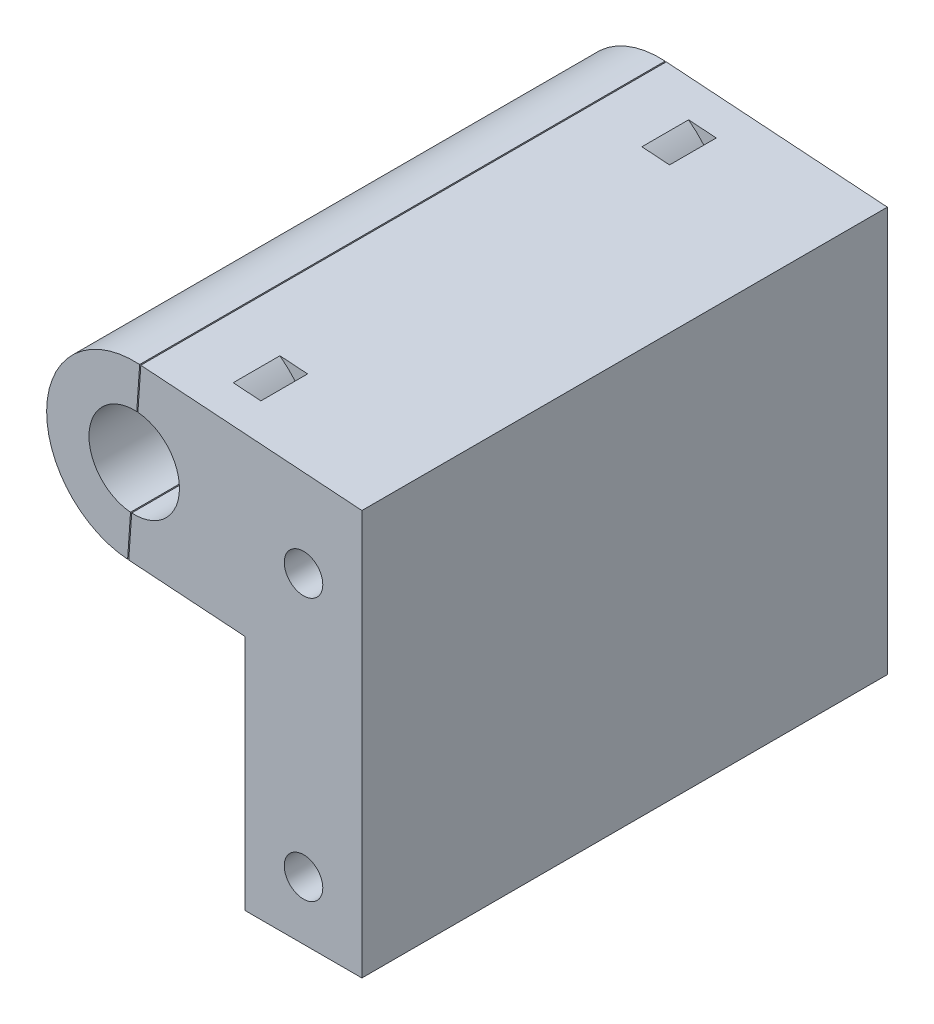
ISO-10303-21;
HEADER;
FILE_DESCRIPTION(('STEP AP214'),'2;1');
FILE_NAME('part.step','',(''),(''),'','','');
FILE_SCHEMA(('AUTOMOTIVE_DESIGN { 1 0 10303 214 1 1 1 1 }'));
ENDSEC;
DATA;
#1=APPLICATION_CONTEXT('core data for automotive mechanical design processes');
#2=APPLICATION_PROTOCOL_DEFINITION('international standard','automotive_design',2000,#1);
#3=PRODUCT_CONTEXT('',#1,'mechanical');
#4=PRODUCT('Part','Part','',(#3));
#5=PRODUCT_RELATED_PRODUCT_CATEGORY('part','',(#4));
#6=PRODUCT_DEFINITION_FORMATION('','',#4);
#7=PRODUCT_DEFINITION_CONTEXT('part definition',#1,'design');
#8=PRODUCT_DEFINITION('design','',#6,#7);
#9=PRODUCT_DEFINITION_SHAPE('','',#8);
#10=(LENGTH_UNIT() NAMED_UNIT(*) SI_UNIT(.MILLI.,.METRE.));
#11=(NAMED_UNIT(*) PLANE_ANGLE_UNIT() SI_UNIT($,.RADIAN.));
#12=(NAMED_UNIT(*) SI_UNIT($,.STERADIAN.) SOLID_ANGLE_UNIT());
#13=UNCERTAINTY_MEASURE_WITH_UNIT(LENGTH_MEASURE(1.E-05),#10,'distance_accuracy_value','');
#14=(GEOMETRIC_REPRESENTATION_CONTEXT(3) GLOBAL_UNCERTAINTY_ASSIGNED_CONTEXT((#13)) GLOBAL_UNIT_ASSIGNED_CONTEXT((#10,
#11,#12)) REPRESENTATION_CONTEXT('',''));
#15=CARTESIAN_POINT('',(0.,0.,0.));
#16=DIRECTION('',(0.,0.,1.));
#17=DIRECTION('',(1.,0.,0.));
#18=AXIS2_PLACEMENT_3D('',#15,#16,#17);
#19=CARTESIAN_POINT('',(-182.516015687115,162.517772536827,45.));
#20=DIRECTION('',(0.0688020916153644,0.997630328422984,0.));
#21=DIRECTION('',(-0.997630328422984,0.0688020916153644,0.));
#22=AXIS2_PLACEMENT_3D('',#19,#20,#21);
#23=PLANE('',#22);
#24=DIRECTION('',(-0.997630328422984,0.0688020916153644,0.));
#25=VECTOR('',#24,1.);
#26=CARTESIAN_POINT('',(-182.516015687115,162.517772536827,7.));
#27=LINE('',#26,#25);
#28=CARTESIAN_POINT('',(-175.184959917431,162.012182483746,7.));
#29=VERTEX_POINT('',#28);
#30=CARTESIAN_POINT('',(-177.552867468828,162.175486452808,7.));
#31=VERTEX_POINT('',#30);
#32=EDGE_CURVE('E287',#29,#31,#27,.T.);
#33=ORIENTED_EDGE('',*,*,#32,.F.);
#34=DIRECTION('',(0.,0.,-1.));
#35=VECTOR('',#34,1.);
#36=CARTESIAN_POINT('',(-175.184959917431,162.012182483746,7.));
#37=LINE('',#36,#35);
#38=CARTESIAN_POINT('',(-175.184959917431,162.012182483746,3.));
#39=VERTEX_POINT('',#38);
#40=EDGE_CURVE('E284',#29,#39,#37,.T.);
#41=ORIENTED_EDGE('',*,*,#40,.T.);
#42=DIRECTION('',(-0.997630328422984,0.0688020916153644,0.));
#43=VECTOR('',#42,1.);
#44=CARTESIAN_POINT('',(-182.516015687115,162.517772536827,3.));
#45=LINE('',#44,#43);
#46=CARTESIAN_POINT('',(-177.552867468828,162.175486452808,3.));
#47=VERTEX_POINT('',#46);
#48=EDGE_CURVE('E217',#39,#47,#45,.T.);
#49=ORIENTED_EDGE('',*,*,#48,.T.);
#50=DIRECTION('',(0.,0.,-1.));
#51=VECTOR('',#50,1.);
#52=CARTESIAN_POINT('',(-177.552867468828,162.175486452808,7.));
#53=LINE('',#52,#51);
#54=EDGE_CURVE('E291',#31,#47,#53,.T.);
#55=ORIENTED_EDGE('',*,*,#54,.F.);
#56=EDGE_LOOP('',(#33,#41,#49,#55));
#57=FACE_BOUND('',#56,.T.);
#58=DIRECTION('',(0.997630328422984,-0.0688020916153644,0.));
#59=VECTOR('',#58,1.);
#60=CARTESIAN_POINT('',(-182.516015687115,162.517772536827,45.));
#61=LINE('',#60,#59);
#62=CARTESIAN_POINT('',(-182.466134170694,162.514332432247,45.));
#63=VERTEX_POINT('',#62);
#64=CARTESIAN_POINT('',(-172.5,161.827012834268,45.));
#65=VERTEX_POINT('',#64);
#66=EDGE_CURVE('E282',#63,#65,#61,.T.);
#67=ORIENTED_EDGE('',*,*,#66,.F.);
#68=DIRECTION('',(0.,0.,-1.));
#69=VECTOR('',#68,1.);
#70=CARTESIAN_POINT('',(-182.466134170694,162.514332432247,45.));
#71=LINE('',#70,#69);
#72=CARTESIAN_POINT('',(-182.466134170694,162.514332432247,0.));
#73=VERTEX_POINT('',#72);
#74=EDGE_CURVE('E86',#63,#73,#71,.T.);
#75=ORIENTED_EDGE('',*,*,#74,.T.);
#76=DIRECTION('',(0.997630328422984,-0.0688020916153644,0.));
#77=VECTOR('',#76,1.);
#78=CARTESIAN_POINT('',(-182.516015687115,162.517772536827,0.));
#79=LINE('',#78,#77);
#80=CARTESIAN_POINT('',(-172.5,161.827012834268,0.));
#81=VERTEX_POINT('',#80);
#82=EDGE_CURVE('E173',#73,#81,#79,.T.);
#83=ORIENTED_EDGE('',*,*,#82,.T.);
#84=DIRECTION('',(0.,0.,-1.));
#85=VECTOR('',#84,1.);
#86=CARTESIAN_POINT('',(-172.5,161.827012834268,45.));
#87=LINE('',#86,#85);
#88=EDGE_CURVE('E256',#65,#81,#87,.T.);
#89=ORIENTED_EDGE('',*,*,#88,.F.);
#90=EDGE_LOOP('',(#67,#75,#83,#89));
#91=FACE_BOUND('',#90,.T.);
#92=DIRECTION('',(0.997630328422984,-0.0688020916153644,0.));
#93=VECTOR('',#92,1.);
#94=CARTESIAN_POINT('',(-182.516015687115,162.517772536827,38.));
#95=LINE('',#94,#93);
#96=CARTESIAN_POINT('',(-177.552867468828,162.175486452808,38.));
#97=VERTEX_POINT('',#96);
#98=CARTESIAN_POINT('',(-175.184959917431,162.012182483746,38.));
#99=VERTEX_POINT('',#98);
#100=EDGE_CURVE('E179',#97,#99,#95,.T.);
#101=ORIENTED_EDGE('',*,*,#100,.F.);
#102=DIRECTION('',(0.,0.,1.));
#103=VECTOR('',#102,1.);
#104=CARTESIAN_POINT('',(-177.552867468828,162.175486452808,38.));
#105=LINE('',#104,#103);
#106=CARTESIAN_POINT('',(-177.552867468828,162.175486452808,42.));
#107=VERTEX_POINT('',#106);
#108=EDGE_CURVE('E162',#97,#107,#105,.T.);
#109=ORIENTED_EDGE('',*,*,#108,.T.);
#110=DIRECTION('',(0.997630328422984,-0.0688020916153644,0.));
#111=VECTOR('',#110,1.);
#112=CARTESIAN_POINT('',(-182.516015687115,162.517772536827,42.));
#113=LINE('',#112,#111);
#114=CARTESIAN_POINT('',(-175.184959917431,162.012182483746,42.));
#115=VERTEX_POINT('',#114);
#116=EDGE_CURVE('E172',#107,#115,#113,.T.);
#117=ORIENTED_EDGE('',*,*,#116,.T.);
#118=DIRECTION('',(0.,0.,1.));
#119=VECTOR('',#118,1.);
#120=CARTESIAN_POINT('',(-175.184959917431,162.012182483746,38.));
#121=LINE('',#120,#119);
#122=EDGE_CURVE('E188',#99,#115,#121,.T.);
#123=ORIENTED_EDGE('',*,*,#122,.F.);
#124=EDGE_LOOP('',(#101,#109,#117,#123));
#125=FACE_BOUND('',#124,.T.);
#126=ADVANCED_FACE('F45',(#57,#91,#125),#23,.F.);
#127=CARTESIAN_POINT('',(-181.483984312885,177.482227463172,45.));
#128=DIRECTION('',(-0.0688020916153632,-0.997630328422984,0.));
#129=DIRECTION('',(0.997630328422984,-0.0688020916153632,0.));
#130=AXIS2_PLACEMENT_3D('',#127,#128,#129);
#131=PLANE('',#130);
#132=DIRECTION('',(0.997630328422984,-0.0688020916153632,0.));
#133=VECTOR('',#132,1.);
#134=CARTESIAN_POINT('',(-181.483984312885,177.482227463172,7.));
#135=LINE('',#134,#133);
#136=CARTESIAN_POINT('',(-176.520836094598,177.139941379152,7.));
#137=VERTEX_POINT('',#136);
#138=CARTESIAN_POINT('',(-174.1529285432,176.976637410091,7.));
#139=VERTEX_POINT('',#138);
#140=EDGE_CURVE('E245',#137,#139,#135,.T.);
#141=ORIENTED_EDGE('',*,*,#140,.F.);
#142=DIRECTION('',(0.,0.,-1.));
#143=VECTOR('',#142,1.);
#144=CARTESIAN_POINT('',(-176.520836094598,177.139941379152,7.));
#145=LINE('',#144,#143);
#146=CARTESIAN_POINT('',(-176.520836094598,177.139941379152,3.));
#147=VERTEX_POINT('',#146);
#148=EDGE_CURVE('E198',#137,#147,#145,.T.);
#149=ORIENTED_EDGE('',*,*,#148,.T.);
#150=DIRECTION('',(0.997630328422984,-0.0688020916153632,0.));
#151=VECTOR('',#150,1.);
#152=CARTESIAN_POINT('',(-181.483984312885,177.482227463172,3.));
#153=LINE('',#152,#151);
#154=CARTESIAN_POINT('',(-174.1529285432,176.976637410091,3.));
#155=VERTEX_POINT('',#154);
#156=EDGE_CURVE('E253',#147,#155,#153,.T.);
#157=ORIENTED_EDGE('',*,*,#156,.T.);
#158=DIRECTION('',(0.,0.,-1.));
#159=VECTOR('',#158,1.);
#160=CARTESIAN_POINT('',(-174.1529285432,176.976637410091,7.));
#161=LINE('',#160,#159);
#162=EDGE_CURVE('E249',#155,#139,#161,.F.);
#163=ORIENTED_EDGE('',*,*,#162,.T.);
#164=EDGE_LOOP('',(#141,#149,#157,#163));
#165=FACE_BOUND('',#164,.T.);
#166=DIRECTION('',(-0.997630328422984,0.0688020916153632,0.));
#167=VECTOR('',#166,1.);
#168=CARTESIAN_POINT('',(-181.483984312885,177.482227463172,0.));
#169=LINE('',#168,#167);
#170=CARTESIAN_POINT('',(-162.5,176.172987165732,0.));
#171=VERTEX_POINT('',#170);
#172=CARTESIAN_POINT('',(-181.434102796463,177.478787358591,0.));
#173=VERTEX_POINT('',#172);
#174=EDGE_CURVE('E252',#171,#173,#169,.T.);
#175=ORIENTED_EDGE('',*,*,#174,.T.);
#176=DIRECTION('',(0.,0.,-1.));
#177=VECTOR('',#176,1.);
#178=CARTESIAN_POINT('',(-181.434102796463,177.478787358591,45.));
#179=LINE('',#178,#177);
#180=CARTESIAN_POINT('',(-181.434102796463,177.478787358591,45.));
#181=VERTEX_POINT('',#180);
#182=EDGE_CURVE('E55',#181,#173,#179,.T.);
#183=ORIENTED_EDGE('',*,*,#182,.F.);
#184=DIRECTION('',(-0.997630328422984,0.0688020916153632,0.));
#185=VECTOR('',#184,1.);
#186=CARTESIAN_POINT('',(-181.483984312885,177.482227463172,45.));
#187=LINE('',#186,#185);
#188=CARTESIAN_POINT('',(-162.5,176.172987165732,45.));
#189=VERTEX_POINT('',#188);
#190=EDGE_CURVE('E220',#189,#181,#187,.T.);
#191=ORIENTED_EDGE('',*,*,#190,.F.);
#192=DIRECTION('',(0.,0.,-1.));
#193=VECTOR('',#192,1.);
#194=CARTESIAN_POINT('',(-162.5,176.172987165732,45.));
#195=LINE('',#194,#193);
#196=EDGE_CURVE('E244',#189,#171,#195,.T.);
#197=ORIENTED_EDGE('',*,*,#196,.T.);
#198=EDGE_LOOP('',(#175,#183,#191,#197));
#199=FACE_BOUND('',#198,.T.);
#200=DIRECTION('',(-0.997630328422984,0.0688020916153632,0.));
#201=VECTOR('',#200,1.);
#202=CARTESIAN_POINT('',(-181.483984312885,177.482227463172,38.));
#203=LINE('',#202,#201);
#204=CARTESIAN_POINT('',(-174.1529285432,176.976637410091,38.));
#205=VERTEX_POINT('',#204);
#206=CARTESIAN_POINT('',(-176.520836094598,177.139941379152,38.));
#207=VERTEX_POINT('',#206);
#208=EDGE_CURVE('E182',#205,#207,#203,.T.);
#209=ORIENTED_EDGE('',*,*,#208,.F.);
#210=DIRECTION('',(0.,0.,1.));
#211=VECTOR('',#210,1.);
#212=CARTESIAN_POINT('',(-174.1529285432,176.976637410091,38.));
#213=LINE('',#212,#211);
#214=CARTESIAN_POINT('',(-174.1529285432,176.976637410091,42.));
#215=VERTEX_POINT('',#214);
#216=EDGE_CURVE('E192',#215,#205,#213,.F.);
#217=ORIENTED_EDGE('',*,*,#216,.F.);
#218=DIRECTION('',(-0.997630328422984,0.0688020916153632,0.));
#219=VECTOR('',#218,1.);
#220=CARTESIAN_POINT('',(-181.483984312885,177.482227463172,42.));
#221=LINE('',#220,#219);
#222=CARTESIAN_POINT('',(-176.520836094598,177.139941379152,42.));
#223=VERTEX_POINT('',#222);
#224=EDGE_CURVE('E240',#215,#223,#221,.T.);
#225=ORIENTED_EDGE('',*,*,#224,.T.);
#226=DIRECTION('',(0.,0.,1.));
#227=VECTOR('',#226,1.);
#228=CARTESIAN_POINT('',(-176.520836094598,177.139941379152,38.));
#229=LINE('',#228,#227);
#230=EDGE_CURVE('E183',#207,#223,#229,.T.);
#231=ORIENTED_EDGE('',*,*,#230,.F.);
#232=EDGE_LOOP('',(#209,#217,#225,#231));
#233=FACE_BOUND('',#232,.T.);
#234=ADVANCED_FACE('F317',(#165,#199,#233),#131,.F.);
#235=CARTESIAN_POINT('',(-172.5,161.827012834268,45.));
#236=DIRECTION('',(1.,0.,0.));
#237=DIRECTION('',(0.,0.,-1.));
#238=AXIS2_PLACEMENT_3D('',#235,#236,#237);
#239=PLANE('',#238);
#240=DIRECTION('',(0.,-1.,0.));
#241=VECTOR('',#240,1.);
#242=CARTESIAN_POINT('',(-172.5,161.827012834268,0.));
#243=LINE('',#242,#241);
#244=CARTESIAN_POINT('',(-172.5,141.5,0.));
#245=VERTEX_POINT('',#244);
#246=EDGE_CURVE('E243',#81,#245,#243,.T.);
#247=ORIENTED_EDGE('',*,*,#246,.T.);
#248=DIRECTION('',(0.,0.,-1.));
#249=VECTOR('',#248,1.);
#250=CARTESIAN_POINT('',(-172.5,141.5,45.));
#251=LINE('',#250,#249);
#252=CARTESIAN_POINT('',(-172.5,141.5,45.));
#253=VERTEX_POINT('',#252);
#254=EDGE_CURVE('E260',#253,#245,#251,.T.);
#255=ORIENTED_EDGE('',*,*,#254,.F.);
#256=DIRECTION('',(0.,-1.,0.));
#257=VECTOR('',#256,1.);
#258=CARTESIAN_POINT('',(-172.5,161.827012834268,45.));
#259=LINE('',#258,#257);
#260=EDGE_CURVE('E280',#65,#253,#259,.T.);
#261=ORIENTED_EDGE('',*,*,#260,.F.);
#262=ORIENTED_EDGE('',*,*,#88,.T.);
#263=EDGE_LOOP('',(#247,#255,#261,#262));
#264=FACE_BOUND('',#263,.T.);
#265=ADVANCED_FACE('F336',(#264),#239,.F.);
#266=CARTESIAN_POINT('',(-172.5,141.5,45.));
#267=DIRECTION('',(0.,1.,0.));
#268=DIRECTION('',(0.,0.,1.));
#269=AXIS2_PLACEMENT_3D('',#266,#267,#268);
#270=PLANE('',#269);
#271=DIRECTION('',(1.,0.,0.));
#272=VECTOR('',#271,1.);
#273=CARTESIAN_POINT('',(-172.5,141.5,0.));
#274=LINE('',#273,#272);
#275=CARTESIAN_POINT('',(-162.5,141.5,0.));
#276=VERTEX_POINT('',#275);
#277=EDGE_CURVE('E259',#245,#276,#274,.T.);
#278=ORIENTED_EDGE('',*,*,#277,.T.);
#279=DIRECTION('',(0.,0.,-1.));
#280=VECTOR('',#279,1.);
#281=CARTESIAN_POINT('',(-162.5,141.5,45.));
#282=LINE('',#281,#280);
#283=CARTESIAN_POINT('',(-162.5,141.5,45.));
#284=VERTEX_POINT('',#283);
#285=EDGE_CURVE('E264',#284,#276,#282,.T.);
#286=ORIENTED_EDGE('',*,*,#285,.F.);
#287=DIRECTION('',(1.,0.,0.));
#288=VECTOR('',#287,1.);
#289=CARTESIAN_POINT('',(-172.5,141.5,45.));
#290=LINE('',#289,#288);
#291=EDGE_CURVE('E278',#253,#284,#290,.T.);
#292=ORIENTED_EDGE('',*,*,#291,.F.);
#293=ORIENTED_EDGE('',*,*,#254,.T.);
#294=EDGE_LOOP('',(#278,#286,#292,#293));
#295=FACE_BOUND('',#294,.T.);
#296=ADVANCED_FACE('F341',(#295),#270,.F.);
#297=CARTESIAN_POINT('',(-162.5,176.172987165732,45.));
#298=DIRECTION('',(-1.,0.,0.));
#299=DIRECTION('',(0.,0.,1.));
#300=AXIS2_PLACEMENT_3D('',#297,#298,#299);
#301=PLANE('',#300);
#302=DIRECTION('',(0.,1.,0.));
#303=VECTOR('',#302,1.);
#304=CARTESIAN_POINT('',(-162.5,176.172987165732,0.));
#305=LINE('',#304,#303);
#306=EDGE_CURVE('E263',#276,#171,#305,.T.);
#307=ORIENTED_EDGE('',*,*,#306,.T.);
#308=ORIENTED_EDGE('',*,*,#196,.F.);
#309=DIRECTION('',(0.,1.,0.));
#310=VECTOR('',#309,1.);
#311=CARTESIAN_POINT('',(-162.5,176.172987165732,45.));
#312=LINE('',#311,#310);
#313=EDGE_CURVE('E276',#284,#189,#312,.T.);
#314=ORIENTED_EDGE('',*,*,#313,.F.);
#315=ORIENTED_EDGE('',*,*,#285,.T.);
#316=EDGE_LOOP('',(#307,#308,#314,#315));
#317=FACE_BOUND('',#316,.T.);
#318=ADVANCED_FACE('F345',(#317),#301,.F.);
#319=CARTESIAN_POINT('',(-182.,170.,45.));
#320=DIRECTION('',(0.,0.,1.));
#321=DIRECTION('',(1.,0.,0.));
#322=AXIS2_PLACEMENT_3D('',#319,#320,#321);
#323=PLANE('',#322);
#324=DIRECTION('',(-0.0688020916153647,-0.997630328422984,0.));
#325=VECTOR('',#324,1.);
#326=CARTESIAN_POINT('',(-181.434102796463,177.478787358591,45.));
#327=LINE('',#326,#325);
#328=CARTESIAN_POINT('',(-182.216704393441,166.131064202411,45.));
#329=VERTEX_POINT('',#328);
#330=EDGE_CURVE('E89',#329,#63,#327,.T.);
#331=ORIENTED_EDGE('',*,*,#330,.T.);
#332=ORIENTED_EDGE('',*,*,#66,.T.);
#333=ORIENTED_EDGE('',*,*,#260,.T.);
#334=ORIENTED_EDGE('',*,*,#291,.T.);
#335=ORIENTED_EDGE('',*,*,#313,.T.);
#336=ORIENTED_EDGE('',*,*,#190,.T.);
#337=CARTESIAN_POINT('',(-181.683532573716,173.862055588427,45.));
#338=VERTEX_POINT('',#337);
#339=EDGE_CURVE('E219',#181,#338,#327,.T.);
#340=ORIENTED_EDGE('',*,*,#339,.T.);
#341=CARTESIAN_POINT('',(-182.,170.,45.));
#342=DIRECTION('',(0.,0.,1.));
#343=DIRECTION('',(1.,0.,0.));
#344=AXIS2_PLACEMENT_3D('',#341,#342,#343);
#345=CIRCLE('',#344,3.87499999999999);
#346=EDGE_CURVE('E49',#329,#338,#345,.T.);
#347=ORIENTED_EDGE('',*,*,#346,.F.);
#348=EDGE_LOOP('',(#331,#332,#333,#334,#335,#336,#340,#347));
#349=FACE_BOUND('',#348,.T.);
#350=CARTESIAN_POINT('',(-167.5,169.,45.));
#351=DIRECTION('',(0.,0.,1.));
#352=DIRECTION('',(1.,0.,0.));
#353=AXIS2_PLACEMENT_3D('',#350,#351,#352);
#354=CIRCLE('',#353,1.64999999999998);
#355=CARTESIAN_POINT('',(-165.85,169.,45.));
#356=VERTEX_POINT('',#355);
#357=EDGE_CURVE('E210',#356,#356,#354,.T.);
#358=ORIENTED_EDGE('',*,*,#357,.F.);
#359=EDGE_LOOP('',(#358));
#360=FACE_BOUND('',#359,.T.);
#361=CARTESIAN_POINT('',(-167.5,146.5,45.));
#362=DIRECTION('',(0.,0.,1.));
#363=DIRECTION('',(1.,0.,0.));
#364=AXIS2_PLACEMENT_3D('',#361,#362,#363);
#365=CIRCLE('',#364,1.64999999999998);
#366=CARTESIAN_POINT('',(-165.85,146.5,45.));
#367=VERTEX_POINT('',#366);
#368=EDGE_CURVE('E199',#367,#367,#365,.T.);
#369=ORIENTED_EDGE('',*,*,#368,.F.);
#370=EDGE_LOOP('',(#369));
#371=FACE_BOUND('',#370,.T.);
#372=ADVANCED_FACE('F47',(#349,#360,#371),#323,.T.);
#373=CARTESIAN_POINT('',(-182.,170.,0.));
#374=DIRECTION('',(0.,0.,1.));
#375=DIRECTION('',(1.,0.,0.));
#376=AXIS2_PLACEMENT_3D('',#373,#374,#375);
#377=PLANE('',#376);
#378=ORIENTED_EDGE('',*,*,#82,.F.);
#379=DIRECTION('',(-0.0688020916153647,-0.997630328422984,0.));
#380=VECTOR('',#379,1.);
#381=CARTESIAN_POINT('',(-181.434102796463,177.478787358591,0.));
#382=LINE('',#381,#380);
#383=CARTESIAN_POINT('',(-182.216704393441,166.131064202411,0.));
#384=VERTEX_POINT('',#383);
#385=EDGE_CURVE('E57',#384,#73,#382,.T.);
#386=ORIENTED_EDGE('',*,*,#385,.F.);
#387=CARTESIAN_POINT('',(-182.,170.,0.));
#388=DIRECTION('',(0.,0.,1.));
#389=DIRECTION('',(1.,0.,0.));
#390=AXIS2_PLACEMENT_3D('',#387,#388,#389);
#391=CIRCLE('',#390,3.87499999999999);
#392=CARTESIAN_POINT('',(-181.683532573716,173.862055588427,0.));
#393=VERTEX_POINT('',#392);
#394=EDGE_CURVE('E213',#384,#393,#391,.T.);
#395=ORIENTED_EDGE('',*,*,#394,.T.);
#396=EDGE_CURVE('E12',#173,#393,#382,.T.);
#397=ORIENTED_EDGE('',*,*,#396,.F.);
#398=ORIENTED_EDGE('',*,*,#174,.F.);
#399=ORIENTED_EDGE('',*,*,#306,.F.);
#400=ORIENTED_EDGE('',*,*,#277,.F.);
#401=ORIENTED_EDGE('',*,*,#246,.F.);
#402=EDGE_LOOP('',(#378,#386,#395,#397,#398,#399,#400,#401));
#403=FACE_BOUND('',#402,.T.);
#404=CARTESIAN_POINT('',(-167.5,169.,0.));
#405=DIRECTION('',(0.,0.,1.));
#406=DIRECTION('',(1.,0.,0.));
#407=AXIS2_PLACEMENT_3D('',#404,#405,#406);
#408=CIRCLE('',#407,1.64999999999998);
#409=CARTESIAN_POINT('',(-165.85,169.,0.));
#410=VERTEX_POINT('',#409);
#411=EDGE_CURVE('E207',#410,#410,#408,.T.);
#412=ORIENTED_EDGE('',*,*,#411,.T.);
#413=EDGE_LOOP('',(#412));
#414=FACE_BOUND('',#413,.T.);
#415=CARTESIAN_POINT('',(-167.5,146.5,0.));
#416=DIRECTION('',(0.,0.,1.));
#417=DIRECTION('',(1.,0.,0.));
#418=AXIS2_PLACEMENT_3D('',#415,#416,#417);
#419=CIRCLE('',#418,1.64999999999998);
#420=CARTESIAN_POINT('',(-165.85,146.5,0.));
#421=VERTEX_POINT('',#420);
#422=EDGE_CURVE('E203',#421,#421,#419,.T.);
#423=ORIENTED_EDGE('',*,*,#422,.T.);
#424=EDGE_LOOP('',(#423));
#425=FACE_BOUND('',#424,.T.);
#426=ADVANCED_FACE('F227',(#403,#414,#425),#377,.F.);
#427=CARTESIAN_POINT('',(-182.,170.,7.));
#428=DIRECTION('',(0.,0.,-1.));
#429=DIRECTION('',(-1.,0.,0.));
#430=AXIS2_PLACEMENT_3D('',#427,#428,#429);
#431=CYLINDRICAL_SURFACE('',#430,10.5);
#432=CARTESIAN_POINT('',(-182.,170.,7.));
#433=DIRECTION('',(0.,0.,-1.));
#434=DIRECTION('',(-1.,0.,0.));
#435=AXIS2_PLACEMENT_3D('',#432,#433,#434);
#436=CIRCLE('',#435,10.5);
#437=EDGE_CURVE('E247',#139,#29,#436,.T.);
#438=ORIENTED_EDGE('',*,*,#437,.F.);
#439=ORIENTED_EDGE('',*,*,#162,.F.);
#440=CARTESIAN_POINT('',(-182.,170.,3.));
#441=DIRECTION('',(0.,0.,-1.));
#442=DIRECTION('',(-1.,0.,0.));
#443=AXIS2_PLACEMENT_3D('',#440,#441,#442);
#444=CIRCLE('',#443,10.5);
#445=EDGE_CURVE('E206',#155,#39,#444,.T.);
#446=ORIENTED_EDGE('',*,*,#445,.T.);
#447=ORIENTED_EDGE('',*,*,#40,.F.);
#448=EDGE_LOOP('',(#438,#439,#446,#447));
#449=FACE_BOUND('',#448,.T.);
#450=ADVANCED_FACE('F319',(#449),#431,.F.);
#451=CARTESIAN_POINT('',(-179.03211955124,173.867468247041,7.));
#452=DIRECTION('',(0.,0.,-1.));
#453=DIRECTION('',(-1.,0.,0.));
#454=AXIS2_PLACEMENT_3D('',#451,#452,#453);
#455=PLANE('',#454);
#456=ORIENTED_EDGE('',*,*,#32,.T.);
#457=CARTESIAN_POINT('',(-182.,170.,7.));
#458=DIRECTION('',(0.,0.,1.));
#459=DIRECTION('',(-1.,0.,0.));
#460=AXIS2_PLACEMENT_3D('',#457,#458,#459);
#461=CIRCLE('',#460,9.);
#462=EDGE_CURVE('E248',#31,#137,#461,.T.);
#463=ORIENTED_EDGE('',*,*,#462,.T.);
#464=ORIENTED_EDGE('',*,*,#140,.T.);
#465=ORIENTED_EDGE('',*,*,#437,.T.);
#466=EDGE_LOOP('',(#456,#463,#464,#465));
#467=FACE_BOUND('',#466,.T.);
#468=ADVANCED_FACE('F306',(#467),#455,.T.);
#469=CARTESIAN_POINT('',(-179.03211955124,173.867468247041,3.));
#470=DIRECTION('',(0.,0.,-1.));
#471=DIRECTION('',(-1.,0.,0.));
#472=AXIS2_PLACEMENT_3D('',#469,#470,#471);
#473=PLANE('',#472);
#474=ORIENTED_EDGE('',*,*,#445,.F.);
#475=ORIENTED_EDGE('',*,*,#156,.F.);
#476=CARTESIAN_POINT('',(-182.,170.,3.));
#477=DIRECTION('',(0.,0.,1.));
#478=DIRECTION('',(-1.,0.,0.));
#479=AXIS2_PLACEMENT_3D('',#476,#477,#478);
#480=CIRCLE('',#479,9.);
#481=EDGE_CURVE('E294',#47,#147,#480,.T.);
#482=ORIENTED_EDGE('',*,*,#481,.F.);
#483=ORIENTED_EDGE('',*,*,#48,.F.);
#484=EDGE_LOOP('',(#474,#475,#482,#483));
#485=FACE_BOUND('',#484,.T.);
#486=ADVANCED_FACE('F321',(#485),#473,.F.);
#487=CARTESIAN_POINT('',(-182.,170.,7.));
#488=DIRECTION('',(0.,0.,-1.));
#489=DIRECTION('',(-1.,0.,0.));
#490=AXIS2_PLACEMENT_3D('',#487,#488,#489);
#491=CYLINDRICAL_SURFACE('',#490,9.);
#492=ORIENTED_EDGE('',*,*,#481,.T.);
#493=ORIENTED_EDGE('',*,*,#148,.F.);
#494=ORIENTED_EDGE('',*,*,#462,.F.);
#495=ORIENTED_EDGE('',*,*,#54,.T.);
#496=EDGE_LOOP('',(#492,#493,#494,#495));
#497=FACE_BOUND('',#496,.T.);
#498=ADVANCED_FACE('F315',(#497),#491,.T.);
#499=CARTESIAN_POINT('',(-182.,170.,38.));
#500=DIRECTION('',(0.,0.,1.));
#501=DIRECTION('',(1.,0.,0.));
#502=AXIS2_PLACEMENT_3D('',#499,#500,#501);
#503=CYLINDRICAL_SURFACE('',#502,10.5);
#504=ORIENTED_EDGE('',*,*,#122,.T.);
#505=CARTESIAN_POINT('',(-182.,170.,42.));
#506=DIRECTION('',(0.,0.,-1.));
#507=DIRECTION('',(-1.,0.,0.));
#508=AXIS2_PLACEMENT_3D('',#505,#506,#507);
#509=CIRCLE('',#508,10.5);
#510=EDGE_CURVE('E184',#215,#115,#509,.T.);
#511=ORIENTED_EDGE('',*,*,#510,.F.);
#512=ORIENTED_EDGE('',*,*,#216,.T.);
#513=CARTESIAN_POINT('',(-182.,170.,38.));
#514=DIRECTION('',(0.,0.,-1.));
#515=DIRECTION('',(-1.,0.,0.));
#516=AXIS2_PLACEMENT_3D('',#513,#514,#515);
#517=CIRCLE('',#516,10.5);
#518=EDGE_CURVE('E189',#205,#99,#517,.T.);
#519=ORIENTED_EDGE('',*,*,#518,.T.);
#520=EDGE_LOOP('',(#504,#511,#512,#519));
#521=FACE_BOUND('',#520,.T.);
#522=ADVANCED_FACE('F328',(#521),#503,.F.);
#523=CARTESIAN_POINT('',(-179.03211955124,173.867468247041,38.));
#524=DIRECTION('',(0.,0.,1.));
#525=DIRECTION('',(-1.,0.,0.));
#526=AXIS2_PLACEMENT_3D('',#523,#524,#525);
#527=PLANE('',#526);
#528=ORIENTED_EDGE('',*,*,#100,.T.);
#529=ORIENTED_EDGE('',*,*,#518,.F.);
#530=ORIENTED_EDGE('',*,*,#208,.T.);
#531=CARTESIAN_POINT('',(-182.,170.,38.));
#532=DIRECTION('',(0.,0.,1.));
#533=DIRECTION('',(-1.,0.,0.));
#534=AXIS2_PLACEMENT_3D('',#531,#532,#533);
#535=CIRCLE('',#534,9.);
#536=EDGE_CURVE('E165',#97,#207,#535,.T.);
#537=ORIENTED_EDGE('',*,*,#536,.F.);
#538=EDGE_LOOP('',(#528,#529,#530,#537));
#539=FACE_BOUND('',#538,.T.);
#540=ADVANCED_FACE('F177',(#539),#527,.T.);
#541=CARTESIAN_POINT('',(-179.03211955124,173.867468247041,42.));
#542=DIRECTION('',(0.,0.,1.));
#543=DIRECTION('',(-1.,0.,0.));
#544=AXIS2_PLACEMENT_3D('',#541,#542,#543);
#545=PLANE('',#544);
#546=CARTESIAN_POINT('',(-182.,170.,42.));
#547=DIRECTION('',(0.,0.,1.));
#548=DIRECTION('',(-1.,0.,0.));
#549=AXIS2_PLACEMENT_3D('',#546,#547,#548);
#550=CIRCLE('',#549,9.);
#551=EDGE_CURVE('E168',#107,#223,#550,.T.);
#552=ORIENTED_EDGE('',*,*,#551,.T.);
#553=ORIENTED_EDGE('',*,*,#224,.F.);
#554=ORIENTED_EDGE('',*,*,#510,.T.);
#555=ORIENTED_EDGE('',*,*,#116,.F.);
#556=EDGE_LOOP('',(#552,#553,#554,#555));
#557=FACE_BOUND('',#556,.T.);
#558=ADVANCED_FACE('F375',(#557),#545,.F.);
#559=CARTESIAN_POINT('',(-182.,170.,38.));
#560=DIRECTION('',(0.,0.,1.));
#561=DIRECTION('',(1.,0.,0.));
#562=AXIS2_PLACEMENT_3D('',#559,#560,#561);
#563=CYLINDRICAL_SURFACE('',#562,9.);
#564=ORIENTED_EDGE('',*,*,#551,.F.);
#565=ORIENTED_EDGE('',*,*,#108,.F.);
#566=ORIENTED_EDGE('',*,*,#536,.T.);
#567=ORIENTED_EDGE('',*,*,#230,.T.);
#568=EDGE_LOOP('',(#564,#565,#566,#567));
#569=FACE_BOUND('',#568,.T.);
#570=ADVANCED_FACE('F164',(#569),#563,.T.);
#571=CARTESIAN_POINT('',(-167.5,146.5,45.));
#572=DIRECTION('',(0.,0.,1.));
#573=DIRECTION('',(1.,0.,0.));
#574=AXIS2_PLACEMENT_3D('',#571,#572,#573);
#575=CYLINDRICAL_SURFACE('',#574,1.64999999999998);
#576=ORIENTED_EDGE('',*,*,#422,.F.);
#577=EDGE_LOOP('',(#576));
#578=FACE_BOUND('',#577,.T.);
#579=ORIENTED_EDGE('',*,*,#368,.T.);
#580=EDGE_LOOP('',(#579));
#581=FACE_BOUND('',#580,.T.);
#582=ADVANCED_FACE('F368',(#578,#581),#575,.F.);
#583=CARTESIAN_POINT('',(-167.5,169.,45.));
#584=DIRECTION('',(0.,0.,1.));
#585=DIRECTION('',(1.,0.,0.));
#586=AXIS2_PLACEMENT_3D('',#583,#584,#585);
#587=CYLINDRICAL_SURFACE('',#586,1.64999999999998);
#588=ORIENTED_EDGE('',*,*,#411,.F.);
#589=EDGE_LOOP('',(#588));
#590=FACE_BOUND('',#589,.T.);
#591=ORIENTED_EDGE('',*,*,#357,.T.);
#592=EDGE_LOOP('',(#591));
#593=FACE_BOUND('',#592,.T.);
#594=ADVANCED_FACE('F362',(#590,#593),#587,.F.);
#595=CARTESIAN_POINT('',(-182.,170.,0.));
#596=DIRECTION('',(0.,0.,1.));
#597=DIRECTION('',(1.,0.,0.));
#598=AXIS2_PLACEMENT_3D('',#595,#596,#597);
#599=CYLINDRICAL_SURFACE('',#598,3.87499999999999);
#600=ORIENTED_EDGE('',*,*,#346,.T.);
#601=DIRECTION('',(0.,0.,1.));
#602=VECTOR('',#601,1.);
#603=CARTESIAN_POINT('',(-181.683532573716,173.862055588427,0.));
#604=LINE('',#603,#602);
#605=EDGE_CURVE('E64',#338,#393,#604,.F.);
#606=ORIENTED_EDGE('',*,*,#605,.T.);
#607=ORIENTED_EDGE('',*,*,#394,.F.);
#608=DIRECTION('',(0.,0.,1.));
#609=VECTOR('',#608,1.);
#610=CARTESIAN_POINT('',(-182.216704393441,166.131064202411,0.));
#611=LINE('',#610,#609);
#612=EDGE_CURVE('E234',#384,#329,#611,.T.);
#613=ORIENTED_EDGE('',*,*,#612,.T.);
#614=EDGE_LOOP('',(#600,#606,#607,#613));
#615=FACE_BOUND('',#614,.T.);
#616=ADVANCED_FACE('F233',(#615),#599,.F.);
#617=CARTESIAN_POINT('',(-181.434102796463,177.478787358591,45.));
#618=DIRECTION('',(0.997630328422984,-0.0688020916153647,0.));
#619=DIRECTION('',(0.0688020916153647,0.997630328422984,0.));
#620=AXIS2_PLACEMENT_3D('',#617,#618,#619);
#621=PLANE('',#620);
#622=ORIENTED_EDGE('',*,*,#385,.T.);
#623=ORIENTED_EDGE('',*,*,#74,.F.);
#624=ORIENTED_EDGE('',*,*,#330,.F.);
#625=ORIENTED_EDGE('',*,*,#612,.F.);
#626=EDGE_LOOP('',(#622,#623,#624,#625));
#627=FACE_BOUND('',#626,.T.);
#628=ADVANCED_FACE('F361',(#627),#621,.F.);
#629=ORIENTED_EDGE('',*,*,#339,.F.);
#630=ORIENTED_EDGE('',*,*,#182,.T.);
#631=ORIENTED_EDGE('',*,*,#396,.T.);
#632=ORIENTED_EDGE('',*,*,#605,.F.);
#633=EDGE_LOOP('',(#629,#630,#631,#632));
#634=FACE_BOUND('',#633,.T.);
#635=ADVANCED_FACE('F363',(#634),#621,.F.);
#636=CLOSED_SHELL('',(#126,#234,#265,#296,#318,#372,#426,#450,#468,#486,#498,#522,#540,#558,
#570,#582,#594,#616,#628,#635));
#637=MANIFOLD_SOLID_BREP('B2',#636);
#638=CARTESIAN_POINT('',(-182.,170.,0.));
#639=DIRECTION('',(0.,0.,1.));
#640=DIRECTION('',(1.,0.,0.));
#641=AXIS2_PLACEMENT_3D('',#638,#639,#640);
#642=CYLINDRICAL_SURFACE('',#641,3.87499999999999);
#643=CARTESIAN_POINT('',(-182.,170.,45.));
#644=DIRECTION('',(0.,0.,1.));
#645=DIRECTION('',(1.,0.,0.));
#646=AXIS2_PLACEMENT_3D('',#643,#644,#645);
#647=CIRCLE('',#646,3.87499999999999);
#648=CARTESIAN_POINT('',(-181.783295606558,173.868935797588,45.));
#649=VERTEX_POINT('',#648);
#650=CARTESIAN_POINT('',(-182.316467426284,166.137944411573,45.));
#651=VERTEX_POINT('',#650);
#652=EDGE_CURVE('E580',#649,#651,#647,.T.);
#653=ORIENTED_EDGE('',*,*,#652,.T.);
#654=DIRECTION('',(0.,0.,1.));
#655=VECTOR('',#654,1.);
#656=CARTESIAN_POINT('',(-182.316467426284,166.137944411573,0.));
#657=LINE('',#656,#655);
#658=CARTESIAN_POINT('',(-182.316467426284,166.137944411573,0.));
#659=VERTEX_POINT('',#658);
#660=EDGE_CURVE('E43',#651,#659,#657,.F.);
#661=ORIENTED_EDGE('',*,*,#660,.T.);
#662=CARTESIAN_POINT('',(-182.,170.,0.));
#663=DIRECTION('',(0.,0.,1.));
#664=DIRECTION('',(1.,0.,0.));
#665=AXIS2_PLACEMENT_3D('',#662,#663,#664);
#666=CIRCLE('',#665,3.87499999999999);
#667=CARTESIAN_POINT('',(-181.783295606558,173.868935797588,0.));
#668=VERTEX_POINT('',#667);
#669=EDGE_CURVE('E589',#668,#659,#666,.T.);
#670=ORIENTED_EDGE('',*,*,#669,.F.);
#671=DIRECTION('',(0.,0.,1.));
#672=VECTOR('',#671,1.);
#673=CARTESIAN_POINT('',(-181.783295606558,173.868935797588,0.));
#674=LINE('',#673,#672);
#675=EDGE_CURVE('E542',#668,#649,#674,.T.);
#676=ORIENTED_EDGE('',*,*,#675,.T.);
#677=EDGE_LOOP('',(#653,#661,#670,#676));
#678=FACE_BOUND('',#677,.T.);
#679=ADVANCED_FACE('F534',(#678),#642,.F.);
#680=CARTESIAN_POINT('',(-182.,170.,0.));
#681=DIRECTION('',(0.,0.,1.));
#682=DIRECTION('',(1.,0.,0.));
#683=AXIS2_PLACEMENT_3D('',#680,#681,#682);
#684=CYLINDRICAL_SURFACE('',#683,7.49999999999999);
#685=DIRECTION('',(0.,0.,1.));
#686=VECTOR('',#685,1.);
#687=CARTESIAN_POINT('',(-182.565885736394,162.521378914977,0.));
#688=LINE('',#687,#686);
#689=CARTESIAN_POINT('',(-182.565885736394,162.521378914977,45.));
#690=VERTEX_POINT('',#689);
#691=CARTESIAN_POINT('',(-182.565885736394,162.521378914977,0.));
#692=VERTEX_POINT('',#691);
#693=EDGE_CURVE('E572',#690,#692,#688,.F.);
#694=ORIENTED_EDGE('',*,*,#693,.F.);
#695=CARTESIAN_POINT('',(-182.,170.,45.));
#696=DIRECTION('',(0.,0.,1.));
#697=DIRECTION('',(1.,0.,0.));
#698=AXIS2_PLACEMENT_3D('',#695,#696,#697);
#699=CIRCLE('',#698,7.49999999999999);
#700=CARTESIAN_POINT('',(-181.533877296448,177.485501294184,45.));
#701=VERTEX_POINT('',#700);
#702=EDGE_CURVE('E594',#701,#690,#699,.T.);
#703=ORIENTED_EDGE('',*,*,#702,.F.);
#704=DIRECTION('',(0.,0.,1.));
#705=VECTOR('',#704,1.);
#706=CARTESIAN_POINT('',(-181.533877296448,177.485501294184,0.));
#707=LINE('',#706,#705);
#708=CARTESIAN_POINT('',(-181.533877296448,177.485501294184,0.));
#709=VERTEX_POINT('',#708);
#710=EDGE_CURVE('E581',#709,#701,#707,.T.);
#711=ORIENTED_EDGE('',*,*,#710,.F.);
#712=CARTESIAN_POINT('',(-182.,170.,0.));
#713=DIRECTION('',(0.,0.,1.));
#714=DIRECTION('',(1.,0.,0.));
#715=AXIS2_PLACEMENT_3D('',#712,#713,#714);
#716=CIRCLE('',#715,7.49999999999999);
#717=EDGE_CURVE('E587',#709,#692,#716,.T.);
#718=ORIENTED_EDGE('',*,*,#717,.T.);
#719=EDGE_LOOP('',(#694,#703,#711,#718));
#720=FACE_BOUND('',#719,.T.);
#721=ADVANCED_FACE('F593',(#720),#684,.T.);
#722=CARTESIAN_POINT('',(-182.,170.,0.));
#723=DIRECTION('',(0.,0.,1.));
#724=DIRECTION('',(1.,0.,0.));
#725=AXIS2_PLACEMENT_3D('',#722,#723,#724);
#726=PLANE('',#725);
#727=ORIENTED_EDGE('',*,*,#717,.F.);
#728=DIRECTION('',(0.0688020916153647,0.997630328422984,0.));
#729=VECTOR('',#728,1.);
#730=CARTESIAN_POINT('',(-181.533865829306,177.485667567753,0.));
#731=LINE('',#730,#729);
#732=EDGE_CURVE('E590',#668,#709,#731,.T.);
#733=ORIENTED_EDGE('',*,*,#732,.F.);
#734=ORIENTED_EDGE('',*,*,#669,.T.);
#735=EDGE_CURVE('E557',#692,#659,#731,.T.);
#736=ORIENTED_EDGE('',*,*,#735,.F.);
#737=EDGE_LOOP('',(#727,#733,#734,#736));
#738=FACE_BOUND('',#737,.T.);
#739=ADVANCED_FACE('F536',(#738),#726,.F.);
#740=CARTESIAN_POINT('',(-182.,170.,45.));
#741=DIRECTION('',(0.,0.,1.));
#742=DIRECTION('',(1.,0.,0.));
#743=AXIS2_PLACEMENT_3D('',#740,#741,#742);
#744=PLANE('',#743);
#745=DIRECTION('',(0.0688020916153647,0.997630328422984,0.));
#746=VECTOR('',#745,1.);
#747=CARTESIAN_POINT('',(-181.533865829306,177.485667567753,45.));
#748=LINE('',#747,#746);
#749=EDGE_CURVE('E549',#649,#701,#748,.T.);
#750=ORIENTED_EDGE('',*,*,#749,.T.);
#751=ORIENTED_EDGE('',*,*,#702,.T.);
#752=EDGE_CURVE('E575',#690,#651,#748,.T.);
#753=ORIENTED_EDGE('',*,*,#752,.T.);
#754=ORIENTED_EDGE('',*,*,#652,.F.);
#755=EDGE_LOOP('',(#750,#751,#753,#754));
#756=FACE_BOUND('',#755,.T.);
#757=ADVANCED_FACE('F604',(#756),#744,.T.);
#758=CARTESIAN_POINT('',(-181.533865829306,177.485667567753,45.));
#759=DIRECTION('',(-0.997630328422984,0.0688020916153647,0.));
#760=DIRECTION('',(-0.0688020916153647,-0.997630328422984,0.));
#761=AXIS2_PLACEMENT_3D('',#758,#759,#760);
#762=PLANE('',#761);
#763=ORIENTED_EDGE('',*,*,#710,.T.);
#764=ORIENTED_EDGE('',*,*,#749,.F.);
#765=ORIENTED_EDGE('',*,*,#675,.F.);
#766=ORIENTED_EDGE('',*,*,#732,.T.);
#767=EDGE_LOOP('',(#763,#764,#765,#766));
#768=FACE_BOUND('',#767,.T.);
#769=ADVANCED_FACE('F606',(#768),#762,.F.);
#770=ORIENTED_EDGE('',*,*,#693,.T.);
#771=ORIENTED_EDGE('',*,*,#735,.T.);
#772=ORIENTED_EDGE('',*,*,#660,.F.);
#773=ORIENTED_EDGE('',*,*,#752,.F.);
#774=EDGE_LOOP('',(#770,#771,#772,#773));
#775=FACE_BOUND('',#774,.T.);
#776=ADVANCED_FACE('F573',(#775),#762,.F.);
#777=CLOSED_SHELL('',(#679,#721,#739,#757,#769,#776));
#778=MANIFOLD_SOLID_BREP('B6',#777);
#779=ADVANCED_BREP_SHAPE_REPRESENTATION('',(#18,#637,#778),#14);
#780=SHAPE_DEFINITION_REPRESENTATION(#9,#779);
ENDSEC;
END-ISO-10303-21;
